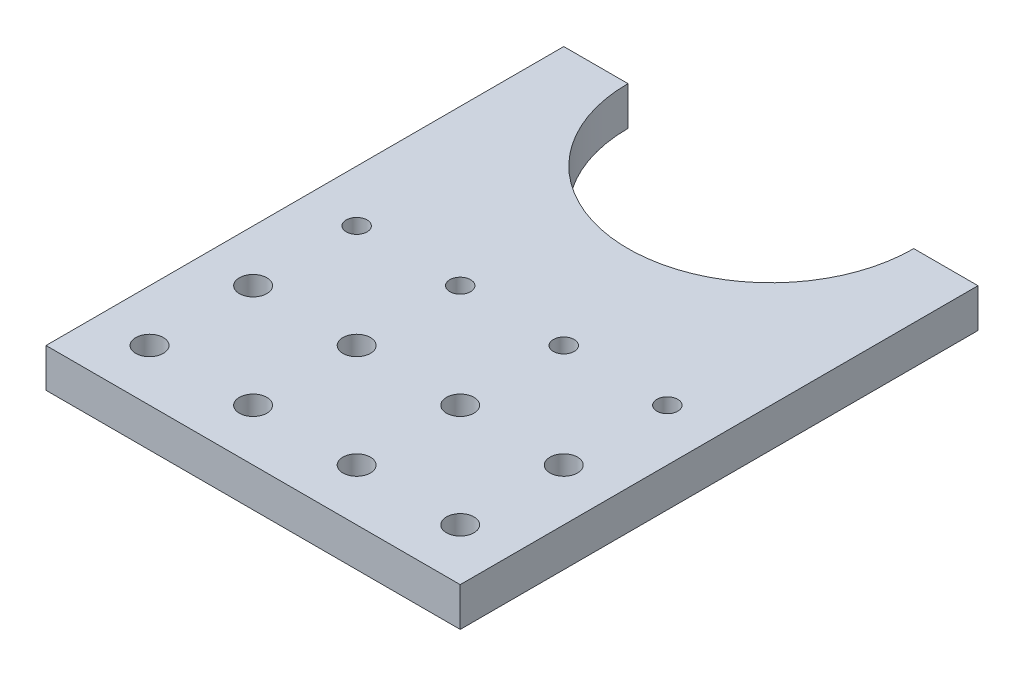
ISO-10303-21;
HEADER;
FILE_DESCRIPTION(('STEP AP214'),'2;1');
FILE_NAME('part.step','',(''),(''),'','','');
FILE_SCHEMA(('AUTOMOTIVE_DESIGN { 1 0 10303 214 1 1 1 1 }'));
ENDSEC;
DATA;
#1=APPLICATION_CONTEXT('core data for automotive mechanical design processes');
#2=APPLICATION_PROTOCOL_DEFINITION('international standard','automotive_design',2000,#1);
#3=PRODUCT_CONTEXT('',#1,'mechanical');
#4=PRODUCT('Part','Part','',(#3));
#5=PRODUCT_RELATED_PRODUCT_CATEGORY('part','',(#4));
#6=PRODUCT_DEFINITION_FORMATION('','',#4);
#7=PRODUCT_DEFINITION_CONTEXT('part definition',#1,'design');
#8=PRODUCT_DEFINITION('design','',#6,#7);
#9=PRODUCT_DEFINITION_SHAPE('','',#8);
#10=(LENGTH_UNIT() NAMED_UNIT(*) SI_UNIT(.MILLI.,.METRE.));
#11=(NAMED_UNIT(*) PLANE_ANGLE_UNIT() SI_UNIT($,.RADIAN.));
#12=(NAMED_UNIT(*) SI_UNIT($,.STERADIAN.) SOLID_ANGLE_UNIT());
#13=UNCERTAINTY_MEASURE_WITH_UNIT(LENGTH_MEASURE(1.E-05),#10,'distance_accuracy_value','');
#14=(GEOMETRIC_REPRESENTATION_CONTEXT(3) GLOBAL_UNCERTAINTY_ASSIGNED_CONTEXT((#13)) GLOBAL_UNIT_ASSIGNED_CONTEXT((#10,
#11,#12)) REPRESENTATION_CONTEXT('',''));
#15=CARTESIAN_POINT('',(0.,0.,0.));
#16=DIRECTION('',(0.,0.,1.));
#17=DIRECTION('',(1.,0.,0.));
#18=AXIS2_PLACEMENT_3D('',#15,#16,#17);
#19=CARTESIAN_POINT('',(0.,9.525,-127.));
#20=DIRECTION('',(0.,0.,1.));
#21=DIRECTION('',(1.,0.,0.));
#22=AXIS2_PLACEMENT_3D('',#19,#20,#21);
#23=PLANE('',#22);
#24=DIRECTION('',(-1.,0.,0.));
#25=VECTOR('',#24,1.);
#26=CARTESIAN_POINT('',(0.,0.,-127.));
#27=LINE('',#26,#25);
#28=CARTESIAN_POINT('',(101.6,0.,-127.));
#29=VERTEX_POINT('',#28);
#30=CARTESIAN_POINT('',(85.852,0.,-127.));
#31=VERTEX_POINT('',#30);
#32=EDGE_CURVE('E110',#29,#31,#27,.T.);
#33=ORIENTED_EDGE('',*,*,#32,.T.);
#34=DIRECTION('',(0.,1.,0.));
#35=VECTOR('',#34,1.);
#36=CARTESIAN_POINT('',(85.852,0.,-127.));
#37=LINE('',#36,#35);
#38=CARTESIAN_POINT('',(85.852,9.525,-127.));
#39=VERTEX_POINT('',#38);
#40=EDGE_CURVE('E47',#31,#39,#37,.T.);
#41=ORIENTED_EDGE('',*,*,#40,.T.);
#42=DIRECTION('',(-1.,0.,0.));
#43=VECTOR('',#42,1.);
#44=CARTESIAN_POINT('',(0.,9.525,-127.));
#45=LINE('',#44,#43);
#46=CARTESIAN_POINT('',(101.6,9.525,-127.));
#47=VERTEX_POINT('',#46);
#48=EDGE_CURVE('E121',#47,#39,#45,.T.);
#49=ORIENTED_EDGE('',*,*,#48,.F.);
#50=DIRECTION('',(0.,-1.,0.));
#51=VECTOR('',#50,1.);
#52=CARTESIAN_POINT('',(101.6,9.525,-127.));
#53=LINE('',#52,#51);
#54=EDGE_CURVE('E120',#47,#29,#53,.T.);
#55=ORIENTED_EDGE('',*,*,#54,.T.);
#56=EDGE_LOOP('',(#33,#41,#49,#55));
#57=FACE_BOUND('',#56,.T.);
#58=ADVANCED_FACE('F32',(#57),#23,.F.);
#59=CARTESIAN_POINT('',(0.,9.525,0.));
#60=DIRECTION('',(1.,0.,0.));
#61=DIRECTION('',(0.,0.,-1.));
#62=AXIS2_PLACEMENT_3D('',#59,#60,#61);
#63=PLANE('',#62);
#64=DIRECTION('',(0.,0.,1.));
#65=VECTOR('',#64,1.);
#66=CARTESIAN_POINT('',(0.,0.,0.));
#67=LINE('',#66,#65);
#68=CARTESIAN_POINT('',(0.,0.,-127.));
#69=VERTEX_POINT('',#68);
#70=CARTESIAN_POINT('',(0.,0.,0.));
#71=VERTEX_POINT('',#70);
#72=EDGE_CURVE('E109',#69,#71,#67,.T.);
#73=ORIENTED_EDGE('',*,*,#72,.T.);
#74=DIRECTION('',(0.,-1.,0.));
#75=VECTOR('',#74,1.);
#76=CARTESIAN_POINT('',(0.,9.525,0.));
#77=LINE('',#76,#75);
#78=CARTESIAN_POINT('',(0.,9.525,0.));
#79=VERTEX_POINT('',#78);
#80=EDGE_CURVE('E100',#79,#71,#77,.T.);
#81=ORIENTED_EDGE('',*,*,#80,.F.);
#82=DIRECTION('',(0.,0.,1.));
#83=VECTOR('',#82,1.);
#84=CARTESIAN_POINT('',(0.,9.525,0.));
#85=LINE('',#84,#83);
#86=CARTESIAN_POINT('',(0.,9.525,-127.));
#87=VERTEX_POINT('',#86);
#88=EDGE_CURVE('E113',#87,#79,#85,.T.);
#89=ORIENTED_EDGE('',*,*,#88,.F.);
#90=DIRECTION('',(0.,-1.,0.));
#91=VECTOR('',#90,1.);
#92=CARTESIAN_POINT('',(0.,9.525,-127.));
#93=LINE('',#92,#91);
#94=EDGE_CURVE('E118',#87,#69,#93,.T.);
#95=ORIENTED_EDGE('',*,*,#94,.T.);
#96=EDGE_LOOP('',(#73,#81,#89,#95));
#97=FACE_BOUND('',#96,.T.);
#98=ADVANCED_FACE('F193',(#97),#63,.F.);
#99=CARTESIAN_POINT('',(0.,9.525,0.));
#100=DIRECTION('',(0.,0.,-1.));
#101=DIRECTION('',(-1.,0.,0.));
#102=AXIS2_PLACEMENT_3D('',#99,#100,#101);
#103=PLANE('',#102);
#104=DIRECTION('',(1.,0.,0.));
#105=VECTOR('',#104,1.);
#106=CARTESIAN_POINT('',(0.,0.,0.));
#107=LINE('',#106,#105);
#108=CARTESIAN_POINT('',(101.6,0.,0.));
#109=VERTEX_POINT('',#108);
#110=EDGE_CURVE('E114',#71,#109,#107,.T.);
#111=ORIENTED_EDGE('',*,*,#110,.T.);
#112=DIRECTION('',(0.,-1.,0.));
#113=VECTOR('',#112,1.);
#114=CARTESIAN_POINT('',(101.6,9.525,0.));
#115=LINE('',#114,#113);
#116=CARTESIAN_POINT('',(101.6,9.525,0.));
#117=VERTEX_POINT('',#116);
#118=EDGE_CURVE('E124',#117,#109,#115,.T.);
#119=ORIENTED_EDGE('',*,*,#118,.F.);
#120=DIRECTION('',(1.,0.,0.));
#121=VECTOR('',#120,1.);
#122=CARTESIAN_POINT('',(0.,9.525,0.));
#123=LINE('',#122,#121);
#124=EDGE_CURVE('E86',#79,#117,#123,.T.);
#125=ORIENTED_EDGE('',*,*,#124,.F.);
#126=ORIENTED_EDGE('',*,*,#80,.T.);
#127=EDGE_LOOP('',(#111,#119,#125,#126));
#128=FACE_BOUND('',#127,.T.);
#129=ADVANCED_FACE('F198',(#128),#103,.F.);
#130=CARTESIAN_POINT('',(101.6,9.525,0.));
#131=DIRECTION('',(-1.,0.,0.));
#132=DIRECTION('',(0.,0.,1.));
#133=AXIS2_PLACEMENT_3D('',#130,#131,#132);
#134=PLANE('',#133);
#135=DIRECTION('',(0.,0.,-1.));
#136=VECTOR('',#135,1.);
#137=CARTESIAN_POINT('',(101.6,0.,0.));
#138=LINE('',#137,#136);
#139=EDGE_CURVE('E111',#109,#29,#138,.T.);
#140=ORIENTED_EDGE('',*,*,#139,.T.);
#141=ORIENTED_EDGE('',*,*,#54,.F.);
#142=DIRECTION('',(0.,0.,-1.));
#143=VECTOR('',#142,1.);
#144=CARTESIAN_POINT('',(101.6,9.525,0.));
#145=LINE('',#144,#143);
#146=EDGE_CURVE('E392',#117,#47,#145,.T.);
#147=ORIENTED_EDGE('',*,*,#146,.F.);
#148=ORIENTED_EDGE('',*,*,#118,.T.);
#149=EDGE_LOOP('',(#140,#141,#147,#148));
#150=FACE_BOUND('',#149,.T.);
#151=ADVANCED_FACE('F187',(#150),#134,.F.);
#152=CARTESIAN_POINT('',(15.748,9.525,-127.));
#153=VERTEX_POINT('',#152);
#154=EDGE_CURVE('E56',#153,#87,#45,.T.);
#155=ORIENTED_EDGE('',*,*,#154,.F.);
#156=DIRECTION('',(0.,1.,0.));
#157=VECTOR('',#156,1.);
#158=CARTESIAN_POINT('',(15.748,0.,-127.));
#159=LINE('',#158,#157);
#160=CARTESIAN_POINT('',(15.748,0.,-127.));
#161=VERTEX_POINT('',#160);
#162=EDGE_CURVE('E95',#153,#161,#159,.F.);
#163=ORIENTED_EDGE('',*,*,#162,.T.);
#164=EDGE_CURVE('E78',#161,#69,#27,.T.);
#165=ORIENTED_EDGE('',*,*,#164,.T.);
#166=ORIENTED_EDGE('',*,*,#94,.F.);
#167=EDGE_LOOP('',(#155,#163,#165,#166));
#168=FACE_BOUND('',#167,.T.);
#169=ADVANCED_FACE('F102',(#168),#23,.F.);
#170=CARTESIAN_POINT('',(0.,9.525,-127.));
#171=DIRECTION('',(0.,-1.,0.));
#172=DIRECTION('',(0.,0.,-1.));
#173=AXIS2_PLACEMENT_3D('',#170,#171,#172);
#174=PLANE('',#173);
#175=CARTESIAN_POINT('',(38.1,9.525,-63.5));
#176=DIRECTION('',(0.,1.,0.));
#177=DIRECTION('',(0.,0.,1.));
#178=AXIS2_PLACEMENT_3D('',#175,#176,#177);
#179=CIRCLE('',#178,2.55269999999999);
#180=CARTESIAN_POINT('',(38.1,9.525,-60.9473));
#181=VERTEX_POINT('',#180);
#182=EDGE_CURVE('E428',#181,#181,#179,.T.);
#183=ORIENTED_EDGE('',*,*,#182,.F.);
#184=EDGE_LOOP('',(#183));
#185=FACE_BOUND('',#184,.T.);
#186=CARTESIAN_POINT('',(12.7,9.525,-63.5));
#187=DIRECTION('',(0.,1.,0.));
#188=DIRECTION('',(0.,0.,1.));
#189=AXIS2_PLACEMENT_3D('',#186,#187,#188);
#190=CIRCLE('',#189,2.55269999999999);
#191=CARTESIAN_POINT('',(12.7,9.525,-60.9473));
#192=VERTEX_POINT('',#191);
#193=EDGE_CURVE('E425',#192,#192,#190,.T.);
#194=ORIENTED_EDGE('',*,*,#193,.F.);
#195=EDGE_LOOP('',(#194));
#196=FACE_BOUND('',#195,.T.);
#197=CARTESIAN_POINT('',(12.7,9.525,-38.1));
#198=DIRECTION('',(0.,1.,0.));
#199=DIRECTION('',(0.,0.,1.));
#200=AXIS2_PLACEMENT_3D('',#197,#198,#199);
#201=CIRCLE('',#200,3.37819999999999);
#202=CARTESIAN_POINT('',(12.7,9.525,-34.7218));
#203=VERTEX_POINT('',#202);
#204=EDGE_CURVE('E380',#203,#203,#201,.T.);
#205=ORIENTED_EDGE('',*,*,#204,.F.);
#206=EDGE_LOOP('',(#205));
#207=FACE_BOUND('',#206,.T.);
#208=CARTESIAN_POINT('',(12.7,9.525,-12.7));
#209=DIRECTION('',(0.,1.,0.));
#210=DIRECTION('',(0.,0.,1.));
#211=AXIS2_PLACEMENT_3D('',#208,#209,#210);
#212=CIRCLE('',#211,3.37819999999999);
#213=CARTESIAN_POINT('',(12.7,9.525,-9.32180000000001));
#214=VERTEX_POINT('',#213);
#215=EDGE_CURVE('E378',#214,#214,#212,.T.);
#216=ORIENTED_EDGE('',*,*,#215,.F.);
#217=EDGE_LOOP('',(#216));
#218=FACE_BOUND('',#217,.T.);
#219=ORIENTED_EDGE('',*,*,#48,.T.);
#220=CARTESIAN_POINT('',(50.8,9.525,-127.));
#221=DIRECTION('',(0.,1.,0.));
#222=DIRECTION('',(0.,0.,1.));
#223=AXIS2_PLACEMENT_3D('',#220,#221,#222);
#224=CIRCLE('',#223,35.052);
#225=EDGE_CURVE('E103',#153,#39,#224,.T.);
#226=ORIENTED_EDGE('',*,*,#225,.F.);
#227=ORIENTED_EDGE('',*,*,#154,.T.);
#228=ORIENTED_EDGE('',*,*,#88,.T.);
#229=ORIENTED_EDGE('',*,*,#124,.T.);
#230=ORIENTED_EDGE('',*,*,#146,.T.);
#231=EDGE_LOOP('',(#219,#226,#227,#228,#229,#230));
#232=FACE_BOUND('',#231,.T.);
#233=CARTESIAN_POINT('',(38.1,9.525,-12.7));
#234=DIRECTION('',(0.,1.,0.));
#235=DIRECTION('',(0.,0.,1.));
#236=AXIS2_PLACEMENT_3D('',#233,#234,#235);
#237=CIRCLE('',#236,3.37819999999999);
#238=CARTESIAN_POINT('',(38.1,9.525,-9.32180000000001));
#239=VERTEX_POINT('',#238);
#240=EDGE_CURVE('E130',#239,#239,#237,.T.);
#241=ORIENTED_EDGE('',*,*,#240,.F.);
#242=EDGE_LOOP('',(#241));
#243=FACE_BOUND('',#242,.T.);
#244=CARTESIAN_POINT('',(38.1,9.525,-38.1));
#245=DIRECTION('',(0.,1.,0.));
#246=DIRECTION('',(0.,0.,1.));
#247=AXIS2_PLACEMENT_3D('',#244,#245,#246);
#248=CIRCLE('',#247,3.37819999999999);
#249=CARTESIAN_POINT('',(38.1,9.525,-34.7218));
#250=VERTEX_POINT('',#249);
#251=EDGE_CURVE('E136',#250,#250,#248,.T.);
#252=ORIENTED_EDGE('',*,*,#251,.F.);
#253=EDGE_LOOP('',(#252));
#254=FACE_BOUND('',#253,.T.);
#255=CARTESIAN_POINT('',(63.5,9.525,-12.7));
#256=DIRECTION('',(0.,1.,0.));
#257=DIRECTION('',(0.,0.,1.));
#258=AXIS2_PLACEMENT_3D('',#255,#256,#257);
#259=CIRCLE('',#258,3.37819999999999);
#260=CARTESIAN_POINT('',(63.5,9.525,-9.32180000000001));
#261=VERTEX_POINT('',#260);
#262=EDGE_CURVE('E142',#261,#261,#259,.T.);
#263=ORIENTED_EDGE('',*,*,#262,.F.);
#264=EDGE_LOOP('',(#263));
#265=FACE_BOUND('',#264,.T.);
#266=CARTESIAN_POINT('',(63.5,9.525,-38.1));
#267=DIRECTION('',(0.,1.,0.));
#268=DIRECTION('',(0.,0.,1.));
#269=AXIS2_PLACEMENT_3D('',#266,#267,#268);
#270=CIRCLE('',#269,3.37819999999999);
#271=CARTESIAN_POINT('',(63.5,9.525,-34.7218));
#272=VERTEX_POINT('',#271);
#273=EDGE_CURVE('E148',#272,#272,#270,.T.);
#274=ORIENTED_EDGE('',*,*,#273,.F.);
#275=EDGE_LOOP('',(#274));
#276=FACE_BOUND('',#275,.T.);
#277=CARTESIAN_POINT('',(88.9,9.525,-12.7));
#278=DIRECTION('',(0.,1.,0.));
#279=DIRECTION('',(0.,0.,1.));
#280=AXIS2_PLACEMENT_3D('',#277,#278,#279);
#281=CIRCLE('',#280,3.37819999999999);
#282=CARTESIAN_POINT('',(88.9,9.525,-9.32180000000001));
#283=VERTEX_POINT('',#282);
#284=EDGE_CURVE('E154',#283,#283,#281,.T.);
#285=ORIENTED_EDGE('',*,*,#284,.F.);
#286=EDGE_LOOP('',(#285));
#287=FACE_BOUND('',#286,.T.);
#288=CARTESIAN_POINT('',(88.9,9.525,-38.1));
#289=DIRECTION('',(0.,1.,0.));
#290=DIRECTION('',(0.,0.,1.));
#291=AXIS2_PLACEMENT_3D('',#288,#289,#290);
#292=CIRCLE('',#291,3.37819999999999);
#293=CARTESIAN_POINT('',(88.9,9.525,-34.7218));
#294=VERTEX_POINT('',#293);
#295=EDGE_CURVE('E160',#294,#294,#292,.T.);
#296=ORIENTED_EDGE('',*,*,#295,.F.);
#297=EDGE_LOOP('',(#296));
#298=FACE_BOUND('',#297,.T.);
#299=CARTESIAN_POINT('',(63.5,9.525,-63.5));
#300=DIRECTION('',(0.,1.,0.));
#301=DIRECTION('',(0.,0.,1.));
#302=AXIS2_PLACEMENT_3D('',#299,#300,#301);
#303=CIRCLE('',#302,2.55269999999999);
#304=CARTESIAN_POINT('',(63.5,9.525,-60.9473));
#305=VERTEX_POINT('',#304);
#306=EDGE_CURVE('E166',#305,#305,#303,.T.);
#307=ORIENTED_EDGE('',*,*,#306,.F.);
#308=EDGE_LOOP('',(#307));
#309=FACE_BOUND('',#308,.T.);
#310=CARTESIAN_POINT('',(88.9,9.525,-63.5));
#311=DIRECTION('',(0.,1.,0.));
#312=DIRECTION('',(0.,0.,1.));
#313=AXIS2_PLACEMENT_3D('',#310,#311,#312);
#314=CIRCLE('',#313,2.55269999999999);
#315=CARTESIAN_POINT('',(88.9,9.525,-60.9473));
#316=VERTEX_POINT('',#315);
#317=EDGE_CURVE('E11',#316,#316,#314,.T.);
#318=ORIENTED_EDGE('',*,*,#317,.F.);
#319=EDGE_LOOP('',(#318));
#320=FACE_BOUND('',#319,.T.);
#321=ADVANCED_FACE('F177',(#185,#196,#207,#218,#232,#243,#254,#265,#276,#287,#298,#309,#320),
#174,.F.);
#322=CARTESIAN_POINT('',(0.,0.,-127.));
#323=DIRECTION('',(0.,-1.,0.));
#324=DIRECTION('',(0.,0.,-1.));
#325=AXIS2_PLACEMENT_3D('',#322,#323,#324);
#326=PLANE('',#325);
#327=CARTESIAN_POINT('',(38.1,0.,-63.5));
#328=DIRECTION('',(0.,1.,0.));
#329=DIRECTION('',(0.,0.,1.));
#330=AXIS2_PLACEMENT_3D('',#327,#328,#329);
#331=CIRCLE('',#330,2.5527);
#332=CARTESIAN_POINT('',(38.1,0.,-60.9473));
#333=VERTEX_POINT('',#332);
#334=EDGE_CURVE('E431',#333,#333,#331,.T.);
#335=ORIENTED_EDGE('',*,*,#334,.T.);
#336=EDGE_LOOP('',(#335));
#337=FACE_BOUND('',#336,.T.);
#338=CARTESIAN_POINT('',(12.7,0.,-63.5));
#339=DIRECTION('',(0.,1.,0.));
#340=DIRECTION('',(0.,0.,1.));
#341=AXIS2_PLACEMENT_3D('',#338,#339,#340);
#342=CIRCLE('',#341,2.5527);
#343=CARTESIAN_POINT('',(12.7,0.,-60.9473));
#344=VERTEX_POINT('',#343);
#345=EDGE_CURVE('E422',#344,#344,#342,.T.);
#346=ORIENTED_EDGE('',*,*,#345,.T.);
#347=EDGE_LOOP('',(#346));
#348=FACE_BOUND('',#347,.T.);
#349=CARTESIAN_POINT('',(12.7,0.,-38.1));
#350=DIRECTION('',(0.,1.,0.));
#351=DIRECTION('',(0.,0.,1.));
#352=AXIS2_PLACEMENT_3D('',#349,#350,#351);
#353=CIRCLE('',#352,3.3782);
#354=CARTESIAN_POINT('',(12.7,0.,-34.7218));
#355=VERTEX_POINT('',#354);
#356=EDGE_CURVE('E384',#355,#355,#353,.T.);
#357=ORIENTED_EDGE('',*,*,#356,.T.);
#358=EDGE_LOOP('',(#357));
#359=FACE_BOUND('',#358,.T.);
#360=CARTESIAN_POINT('',(12.7,0.,-12.7));
#361=DIRECTION('',(0.,1.,0.));
#362=DIRECTION('',(0.,0.,1.));
#363=AXIS2_PLACEMENT_3D('',#360,#361,#362);
#364=CIRCLE('',#363,3.3782);
#365=CARTESIAN_POINT('',(12.7,0.,-9.3218));
#366=VERTEX_POINT('',#365);
#367=EDGE_CURVE('E375',#366,#366,#364,.T.);
#368=ORIENTED_EDGE('',*,*,#367,.T.);
#369=EDGE_LOOP('',(#368));
#370=FACE_BOUND('',#369,.T.);
#371=CARTESIAN_POINT('',(50.8,0.,-127.));
#372=DIRECTION('',(0.,-1.,0.));
#373=DIRECTION('',(0.,0.,-1.));
#374=AXIS2_PLACEMENT_3D('',#371,#372,#373);
#375=CIRCLE('',#374,35.052);
#376=EDGE_CURVE('E93',#31,#161,#375,.T.);
#377=ORIENTED_EDGE('',*,*,#376,.F.);
#378=ORIENTED_EDGE('',*,*,#32,.F.);
#379=ORIENTED_EDGE('',*,*,#139,.F.);
#380=ORIENTED_EDGE('',*,*,#110,.F.);
#381=ORIENTED_EDGE('',*,*,#72,.F.);
#382=ORIENTED_EDGE('',*,*,#164,.F.);
#383=EDGE_LOOP('',(#377,#378,#379,#380,#381,#382));
#384=FACE_BOUND('',#383,.T.);
#385=CARTESIAN_POINT('',(38.1,0.,-12.7));
#386=DIRECTION('',(0.,1.,0.));
#387=DIRECTION('',(0.,0.,1.));
#388=AXIS2_PLACEMENT_3D('',#385,#386,#387);
#389=CIRCLE('',#388,3.3782);
#390=CARTESIAN_POINT('',(38.1,0.,-9.3218));
#391=VERTEX_POINT('',#390);
#392=EDGE_CURVE('E99',#391,#391,#389,.T.);
#393=ORIENTED_EDGE('',*,*,#392,.T.);
#394=EDGE_LOOP('',(#393));
#395=FACE_BOUND('',#394,.T.);
#396=CARTESIAN_POINT('',(38.1,0.,-38.1));
#397=DIRECTION('',(0.,1.,0.));
#398=DIRECTION('',(0.,0.,1.));
#399=AXIS2_PLACEMENT_3D('',#396,#397,#398);
#400=CIRCLE('',#399,3.3782);
#401=CARTESIAN_POINT('',(38.1,0.,-34.7218));
#402=VERTEX_POINT('',#401);
#403=EDGE_CURVE('E133',#402,#402,#400,.T.);
#404=ORIENTED_EDGE('',*,*,#403,.T.);
#405=EDGE_LOOP('',(#404));
#406=FACE_BOUND('',#405,.T.);
#407=CARTESIAN_POINT('',(63.5,0.,-12.7));
#408=DIRECTION('',(0.,1.,0.));
#409=DIRECTION('',(0.,0.,1.));
#410=AXIS2_PLACEMENT_3D('',#407,#408,#409);
#411=CIRCLE('',#410,3.3782);
#412=CARTESIAN_POINT('',(63.5,0.,-9.3218));
#413=VERTEX_POINT('',#412);
#414=EDGE_CURVE('E139',#413,#413,#411,.T.);
#415=ORIENTED_EDGE('',*,*,#414,.T.);
#416=EDGE_LOOP('',(#415));
#417=FACE_BOUND('',#416,.T.);
#418=CARTESIAN_POINT('',(63.5,0.,-38.1));
#419=DIRECTION('',(0.,1.,0.));
#420=DIRECTION('',(0.,0.,1.));
#421=AXIS2_PLACEMENT_3D('',#418,#419,#420);
#422=CIRCLE('',#421,3.3782);
#423=CARTESIAN_POINT('',(63.5,0.,-34.7218));
#424=VERTEX_POINT('',#423);
#425=EDGE_CURVE('E145',#424,#424,#422,.T.);
#426=ORIENTED_EDGE('',*,*,#425,.T.);
#427=EDGE_LOOP('',(#426));
#428=FACE_BOUND('',#427,.T.);
#429=CARTESIAN_POINT('',(88.9,0.,-12.7));
#430=DIRECTION('',(0.,1.,0.));
#431=DIRECTION('',(0.,0.,1.));
#432=AXIS2_PLACEMENT_3D('',#429,#430,#431);
#433=CIRCLE('',#432,3.3782);
#434=CARTESIAN_POINT('',(88.9,0.,-9.3218));
#435=VERTEX_POINT('',#434);
#436=EDGE_CURVE('E151',#435,#435,#433,.T.);
#437=ORIENTED_EDGE('',*,*,#436,.T.);
#438=EDGE_LOOP('',(#437));
#439=FACE_BOUND('',#438,.T.);
#440=CARTESIAN_POINT('',(88.9,0.,-38.1));
#441=DIRECTION('',(0.,1.,0.));
#442=DIRECTION('',(0.,0.,1.));
#443=AXIS2_PLACEMENT_3D('',#440,#441,#442);
#444=CIRCLE('',#443,3.3782);
#445=CARTESIAN_POINT('',(88.9,0.,-34.7218));
#446=VERTEX_POINT('',#445);
#447=EDGE_CURVE('E157',#446,#446,#444,.T.);
#448=ORIENTED_EDGE('',*,*,#447,.T.);
#449=EDGE_LOOP('',(#448));
#450=FACE_BOUND('',#449,.T.);
#451=CARTESIAN_POINT('',(63.5,0.,-63.5));
#452=DIRECTION('',(0.,1.,0.));
#453=DIRECTION('',(0.,0.,1.));
#454=AXIS2_PLACEMENT_3D('',#451,#452,#453);
#455=CIRCLE('',#454,2.5527);
#456=CARTESIAN_POINT('',(63.5,0.,-60.9473));
#457=VERTEX_POINT('',#456);
#458=EDGE_CURVE('E163',#457,#457,#455,.T.);
#459=ORIENTED_EDGE('',*,*,#458,.T.);
#460=EDGE_LOOP('',(#459));
#461=FACE_BOUND('',#460,.T.);
#462=CARTESIAN_POINT('',(88.9,0.,-63.5));
#463=DIRECTION('',(0.,1.,0.));
#464=DIRECTION('',(0.,0.,1.));
#465=AXIS2_PLACEMENT_3D('',#462,#463,#464);
#466=CIRCLE('',#465,2.5527);
#467=CARTESIAN_POINT('',(88.9,0.,-60.9473));
#468=VERTEX_POINT('',#467);
#469=EDGE_CURVE('E40',#468,#468,#466,.T.);
#470=ORIENTED_EDGE('',*,*,#469,.T.);
#471=EDGE_LOOP('',(#470));
#472=FACE_BOUND('',#471,.T.);
#473=ADVANCED_FACE('F106',(#337,#348,#359,#370,#384,#395,#406,#417,#428,#439,#450,#461,#472),
#326,.T.);
#474=CARTESIAN_POINT('',(50.8,0.,-127.));
#475=DIRECTION('',(0.,1.,0.));
#476=DIRECTION('',(0.,0.,1.));
#477=AXIS2_PLACEMENT_3D('',#474,#475,#476);
#478=CYLINDRICAL_SURFACE('',#477,35.052);
#479=ORIENTED_EDGE('',*,*,#376,.T.);
#480=ORIENTED_EDGE('',*,*,#162,.F.);
#481=ORIENTED_EDGE('',*,*,#225,.T.);
#482=ORIENTED_EDGE('',*,*,#40,.F.);
#483=EDGE_LOOP('',(#479,#480,#481,#482));
#484=FACE_BOUND('',#483,.T.);
#485=ADVANCED_FACE('F94',(#484),#478,.F.);
#486=CARTESIAN_POINT('',(12.7,9.525,-12.7));
#487=DIRECTION('',(0.,1.,0.));
#488=DIRECTION('',(0.,0.,1.));
#489=AXIS2_PLACEMENT_3D('',#486,#487,#488);
#490=CYLINDRICAL_SURFACE('',#489,3.37819999999999);
#491=ORIENTED_EDGE('',*,*,#367,.F.);
#492=EDGE_LOOP('',(#491));
#493=FACE_BOUND('',#492,.T.);
#494=ORIENTED_EDGE('',*,*,#215,.T.);
#495=EDGE_LOOP('',(#494));
#496=FACE_BOUND('',#495,.T.);
#497=ADVANCED_FACE('F255',(#493,#496),#490,.F.);
#498=CARTESIAN_POINT('',(12.7,9.525,-38.1));
#499=DIRECTION('',(0.,1.,0.));
#500=DIRECTION('',(0.,0.,1.));
#501=AXIS2_PLACEMENT_3D('',#498,#499,#500);
#502=CYLINDRICAL_SURFACE('',#501,3.37819999999999);
#503=ORIENTED_EDGE('',*,*,#356,.F.);
#504=EDGE_LOOP('',(#503));
#505=FACE_BOUND('',#504,.T.);
#506=ORIENTED_EDGE('',*,*,#204,.T.);
#507=EDGE_LOOP('',(#506));
#508=FACE_BOUND('',#507,.T.);
#509=ADVANCED_FACE('F211',(#505,#508),#502,.F.);
#510=CARTESIAN_POINT('',(38.1,9.525,-12.7));
#511=DIRECTION('',(0.,1.,0.));
#512=DIRECTION('',(0.,0.,1.));
#513=AXIS2_PLACEMENT_3D('',#510,#511,#512);
#514=CYLINDRICAL_SURFACE('',#513,3.37819999999999);
#515=ORIENTED_EDGE('',*,*,#392,.F.);
#516=EDGE_LOOP('',(#515));
#517=FACE_BOUND('',#516,.T.);
#518=ORIENTED_EDGE('',*,*,#240,.T.);
#519=EDGE_LOOP('',(#518));
#520=FACE_BOUND('',#519,.T.);
#521=ADVANCED_FACE('F207',(#517,#520),#514,.F.);
#522=CARTESIAN_POINT('',(38.1,9.525,-38.1));
#523=DIRECTION('',(0.,1.,0.));
#524=DIRECTION('',(0.,0.,1.));
#525=AXIS2_PLACEMENT_3D('',#522,#523,#524);
#526=CYLINDRICAL_SURFACE('',#525,3.37819999999999);
#527=ORIENTED_EDGE('',*,*,#403,.F.);
#528=EDGE_LOOP('',(#527));
#529=FACE_BOUND('',#528,.T.);
#530=ORIENTED_EDGE('',*,*,#251,.T.);
#531=EDGE_LOOP('',(#530));
#532=FACE_BOUND('',#531,.T.);
#533=ADVANCED_FACE('F210',(#529,#532),#526,.F.);
#534=CARTESIAN_POINT('',(63.5,9.525,-12.7));
#535=DIRECTION('',(0.,1.,0.));
#536=DIRECTION('',(0.,0.,1.));
#537=AXIS2_PLACEMENT_3D('',#534,#535,#536);
#538=CYLINDRICAL_SURFACE('',#537,3.37819999999999);
#539=ORIENTED_EDGE('',*,*,#414,.F.);
#540=EDGE_LOOP('',(#539));
#541=FACE_BOUND('',#540,.T.);
#542=ORIENTED_EDGE('',*,*,#262,.T.);
#543=EDGE_LOOP('',(#542));
#544=FACE_BOUND('',#543,.T.);
#545=ADVANCED_FACE('F215',(#541,#544),#538,.F.);
#546=CARTESIAN_POINT('',(63.5,9.525,-38.1));
#547=DIRECTION('',(0.,1.,0.));
#548=DIRECTION('',(0.,0.,1.));
#549=AXIS2_PLACEMENT_3D('',#546,#547,#548);
#550=CYLINDRICAL_SURFACE('',#549,3.37819999999999);
#551=ORIENTED_EDGE('',*,*,#425,.F.);
#552=EDGE_LOOP('',(#551));
#553=FACE_BOUND('',#552,.T.);
#554=ORIENTED_EDGE('',*,*,#273,.T.);
#555=EDGE_LOOP('',(#554));
#556=FACE_BOUND('',#555,.T.);
#557=ADVANCED_FACE('F219',(#553,#556),#550,.F.);
#558=CARTESIAN_POINT('',(88.9,9.525,-12.7));
#559=DIRECTION('',(0.,1.,0.));
#560=DIRECTION('',(0.,0.,1.));
#561=AXIS2_PLACEMENT_3D('',#558,#559,#560);
#562=CYLINDRICAL_SURFACE('',#561,3.37819999999999);
#563=ORIENTED_EDGE('',*,*,#436,.F.);
#564=EDGE_LOOP('',(#563));
#565=FACE_BOUND('',#564,.T.);
#566=ORIENTED_EDGE('',*,*,#284,.T.);
#567=EDGE_LOOP('',(#566));
#568=FACE_BOUND('',#567,.T.);
#569=ADVANCED_FACE('F223',(#565,#568),#562,.F.);
#570=CARTESIAN_POINT('',(88.9,9.525,-38.1));
#571=DIRECTION('',(0.,1.,0.));
#572=DIRECTION('',(0.,0.,1.));
#573=AXIS2_PLACEMENT_3D('',#570,#571,#572);
#574=CYLINDRICAL_SURFACE('',#573,3.37819999999999);
#575=ORIENTED_EDGE('',*,*,#447,.F.);
#576=EDGE_LOOP('',(#575));
#577=FACE_BOUND('',#576,.T.);
#578=ORIENTED_EDGE('',*,*,#295,.T.);
#579=EDGE_LOOP('',(#578));
#580=FACE_BOUND('',#579,.T.);
#581=ADVANCED_FACE('F227',(#577,#580),#574,.F.);
#582=CARTESIAN_POINT('',(12.7,9.525,-63.5));
#583=DIRECTION('',(0.,1.,0.));
#584=DIRECTION('',(0.,0.,1.));
#585=AXIS2_PLACEMENT_3D('',#582,#583,#584);
#586=CYLINDRICAL_SURFACE('',#585,2.55269999999999);
#587=ORIENTED_EDGE('',*,*,#345,.F.);
#588=EDGE_LOOP('',(#587));
#589=FACE_BOUND('',#588,.T.);
#590=ORIENTED_EDGE('',*,*,#193,.T.);
#591=EDGE_LOOP('',(#590));
#592=FACE_BOUND('',#591,.T.);
#593=ADVANCED_FACE('F230',(#589,#592),#586,.F.);
#594=CARTESIAN_POINT('',(38.1,9.525,-63.5));
#595=DIRECTION('',(0.,1.,0.));
#596=DIRECTION('',(0.,0.,1.));
#597=AXIS2_PLACEMENT_3D('',#594,#595,#596);
#598=CYLINDRICAL_SURFACE('',#597,2.55269999999999);
#599=ORIENTED_EDGE('',*,*,#334,.F.);
#600=EDGE_LOOP('',(#599));
#601=FACE_BOUND('',#600,.T.);
#602=ORIENTED_EDGE('',*,*,#182,.T.);
#603=EDGE_LOOP('',(#602));
#604=FACE_BOUND('',#603,.T.);
#605=ADVANCED_FACE('F233',(#601,#604),#598,.F.);
#606=CARTESIAN_POINT('',(63.5,9.525,-63.5));
#607=DIRECTION('',(0.,1.,0.));
#608=DIRECTION('',(0.,0.,1.));
#609=AXIS2_PLACEMENT_3D('',#606,#607,#608);
#610=CYLINDRICAL_SURFACE('',#609,2.55269999999999);
#611=ORIENTED_EDGE('',*,*,#458,.F.);
#612=EDGE_LOOP('',(#611));
#613=FACE_BOUND('',#612,.T.);
#614=ORIENTED_EDGE('',*,*,#306,.T.);
#615=EDGE_LOOP('',(#614));
#616=FACE_BOUND('',#615,.T.);
#617=ADVANCED_FACE('F174',(#613,#616),#610,.F.);
#618=CARTESIAN_POINT('',(88.9,9.525,-63.5));
#619=DIRECTION('',(0.,1.,0.));
#620=DIRECTION('',(0.,0.,1.));
#621=AXIS2_PLACEMENT_3D('',#618,#619,#620);
#622=CYLINDRICAL_SURFACE('',#621,2.55269999999999);
#623=ORIENTED_EDGE('',*,*,#469,.F.);
#624=EDGE_LOOP('',(#623));
#625=FACE_BOUND('',#624,.T.);
#626=ORIENTED_EDGE('',*,*,#317,.T.);
#627=EDGE_LOOP('',(#626));
#628=FACE_BOUND('',#627,.T.);
#629=ADVANCED_FACE('F34',(#625,#628),#622,.F.);
#630=CLOSED_SHELL('',(#58,#98,#129,#151,#169,#321,#473,#485,#497,#509,#521,#533,#545,#557,#569,
#581,#593,#605,#617,#629));
#631=MANIFOLD_SOLID_BREP('B2',#630);
#632=ADVANCED_BREP_SHAPE_REPRESENTATION('',(#18,#631),#14);
#633=SHAPE_DEFINITION_REPRESENTATION(#9,#632);
ENDSEC;
END-ISO-10303-21;
